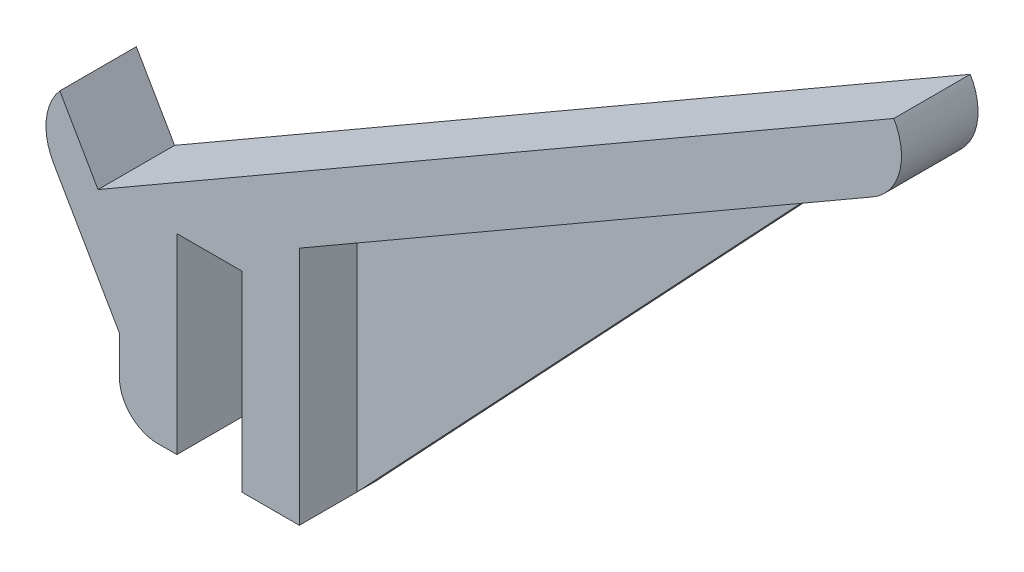
ISO-10303-21;
HEADER;
FILE_DESCRIPTION(('STEP AP214'),'2;1');
FILE_NAME('part.step','',(''),(''),'','','');
FILE_SCHEMA(('AUTOMOTIVE_DESIGN { 1 0 10303 214 1 1 1 1 }'));
ENDSEC;
DATA;
#1=APPLICATION_CONTEXT('core data for automotive mechanical design processes');
#2=APPLICATION_PROTOCOL_DEFINITION('international standard','automotive_design',2000,#1);
#3=PRODUCT_CONTEXT('',#1,'mechanical');
#4=PRODUCT('Part','Part','',(#3));
#5=PRODUCT_RELATED_PRODUCT_CATEGORY('part','',(#4));
#6=PRODUCT_DEFINITION_FORMATION('','',#4);
#7=PRODUCT_DEFINITION_CONTEXT('part definition',#1,'design');
#8=PRODUCT_DEFINITION('design','',#6,#7);
#9=PRODUCT_DEFINITION_SHAPE('','',#8);
#10=(LENGTH_UNIT() NAMED_UNIT(*) SI_UNIT(.MILLI.,.METRE.));
#11=(NAMED_UNIT(*) PLANE_ANGLE_UNIT() SI_UNIT($,.RADIAN.));
#12=(NAMED_UNIT(*) SI_UNIT($,.STERADIAN.) SOLID_ANGLE_UNIT());
#13=UNCERTAINTY_MEASURE_WITH_UNIT(LENGTH_MEASURE(1.E-05),#10,'distance_accuracy_value','');
#14=(GEOMETRIC_REPRESENTATION_CONTEXT(3) GLOBAL_UNCERTAINTY_ASSIGNED_CONTEXT((#13)) GLOBAL_UNIT_ASSIGNED_CONTEXT((#10,
#11,#12)) REPRESENTATION_CONTEXT('',''));
#15=CARTESIAN_POINT('',(0.,0.,0.));
#16=DIRECTION('',(0.,0.,1.));
#17=DIRECTION('',(1.,0.,0.));
#18=AXIS2_PLACEMENT_3D('',#15,#16,#17);
#19=CARTESIAN_POINT('',(15.,-50.,20.));
#20=DIRECTION('',(-1.,0.,0.));
#21=DIRECTION('',(0.,0.,1.));
#22=AXIS2_PLACEMENT_3D('',#19,#20,#21);
#23=PLANE('',#22);
#24=DIRECTION('',(0.,-1.,0.));
#25=VECTOR('',#24,1.);
#26=CARTESIAN_POINT('',(15.,12.7017059221715,5.));
#27=LINE('',#26,#25);
#28=CARTESIAN_POINT('',(15.,12.7017059221715,5.));
#29=VERTEX_POINT('',#28);
#30=CARTESIAN_POINT('',(15.,-50.,5.));
#31=VERTEX_POINT('',#30);
#32=EDGE_CURVE('E166',#29,#31,#27,.T.);
#33=ORIENTED_EDGE('',*,*,#32,.F.);
#34=DIRECTION('',(0.,0.,-1.));
#35=VECTOR('',#34,1.);
#36=CARTESIAN_POINT('',(15.,12.7017059221715,20.));
#37=LINE('',#36,#35);
#38=CARTESIAN_POINT('',(15.,12.7017059221715,20.));
#39=VERTEX_POINT('',#38);
#40=EDGE_CURVE('E236',#39,#29,#37,.T.);
#41=ORIENTED_EDGE('',*,*,#40,.F.);
#42=DIRECTION('',(0.,1.,0.));
#43=VECTOR('',#42,1.);
#44=CARTESIAN_POINT('',(15.,-50.,20.));
#45=LINE('',#44,#43);
#46=CARTESIAN_POINT('',(15.,-50.,20.));
#47=VERTEX_POINT('',#46);
#48=EDGE_CURVE('E184',#47,#39,#45,.T.);
#49=ORIENTED_EDGE('',*,*,#48,.F.);
#50=DIRECTION('',(0.,0.,-1.));
#51=VECTOR('',#50,1.);
#52=CARTESIAN_POINT('',(15.,-50.,20.));
#53=LINE('',#52,#51);
#54=EDGE_CURVE('E238',#47,#31,#53,.T.);
#55=ORIENTED_EDGE('',*,*,#54,.T.);
#56=EDGE_LOOP('',(#33,#41,#49,#55));
#57=FACE_BOUND('',#56,.T.);
#58=ADVANCED_FACE('F37',(#57),#23,.F.);
#59=CARTESIAN_POINT('',(15.,12.7017059221715,20.));
#60=DIRECTION('',(-0.500000000000001,0.866025403784438,0.));
#61=DIRECTION('',(-0.866025403784438,-0.500000000000001,0.));
#62=AXIS2_PLACEMENT_3D('',#59,#60,#61);
#63=PLANE('',#62);
#64=DIRECTION('',(0.866025403784438,0.500000000000001,0.));
#65=VECTOR('',#64,1.);
#66=CARTESIAN_POINT('',(15.,12.7017059221715,0.));
#67=LINE('',#66,#65);
#68=CARTESIAN_POINT('',(143.985349670657,87.1714322760432,0.));
#69=VERTEX_POINT('',#68);
#70=CARTESIAN_POINT('',(164.775588832577,99.1746824526945,0.));
#71=VERTEX_POINT('',#70);
#72=EDGE_CURVE('E144',#69,#71,#67,.T.);
#73=ORIENTED_EDGE('',*,*,#72,.T.);
#74=DIRECTION('',(0.,0.,-1.));
#75=VECTOR('',#74,1.);
#76=CARTESIAN_POINT('',(164.775588832576,99.1746824526945,20.));
#77=LINE('',#76,#75);
#78=CARTESIAN_POINT('',(164.775588832577,99.1746824526945,20.));
#79=VERTEX_POINT('',#78);
#80=EDGE_CURVE('E45',#71,#79,#77,.F.);
#81=ORIENTED_EDGE('',*,*,#80,.T.);
#82=DIRECTION('',(0.866025403784438,0.500000000000001,0.));
#83=VECTOR('',#82,1.);
#84=CARTESIAN_POINT('',(15.,12.7017059221715,20.));
#85=LINE('',#84,#83);
#86=EDGE_CURVE('E186',#39,#79,#85,.T.);
#87=ORIENTED_EDGE('',*,*,#86,.F.);
#88=ORIENTED_EDGE('',*,*,#40,.T.);
#89=DIRECTION('',(-0.866025403784439,-0.5,0.));
#90=VECTOR('',#89,1.);
#91=CARTESIAN_POINT('',(143.985349670657,87.1714322760432,5.));
#92=LINE('',#91,#90);
#93=CARTESIAN_POINT('',(143.985349670657,87.1714322760434,5.));
#94=VERTEX_POINT('',#93);
#95=EDGE_CURVE('E159',#94,#29,#92,.T.);
#96=ORIENTED_EDGE('',*,*,#95,.F.);
#97=DIRECTION('',(0.,0.,-1.));
#98=VECTOR('',#97,1.);
#99=CARTESIAN_POINT('',(143.985349670657,87.1714322760432,5.));
#100=LINE('',#99,#98);
#101=EDGE_CURVE('E155',#94,#69,#100,.T.);
#102=ORIENTED_EDGE('',*,*,#101,.T.);
#103=EDGE_LOOP('',(#73,#81,#87,#88,#96,#102));
#104=FACE_BOUND('',#103,.T.);
#105=ADVANCED_FACE('F156',(#104),#63,.F.);
#106=CARTESIAN_POINT('',(0.,0.,20.));
#107=DIRECTION('',(0.,1.,0.));
#108=DIRECTION('',(0.,0.,1.));
#109=AXIS2_PLACEMENT_3D('',#106,#107,#108);
#110=PLANE('',#109);
#111=DIRECTION('',(1.,0.,0.));
#112=VECTOR('',#111,1.);
#113=CARTESIAN_POINT('',(0.,0.,0.));
#114=LINE('',#113,#112);
#115=CARTESIAN_POINT('',(-17.,0.,0.));
#116=VERTEX_POINT('',#115);
#117=CARTESIAN_POINT('',(0.,0.,0.));
#118=VERTEX_POINT('',#117);
#119=EDGE_CURVE('E175',#116,#118,#114,.T.);
#120=ORIENTED_EDGE('',*,*,#119,.T.);
#121=DIRECTION('',(0.,0.,-1.));
#122=VECTOR('',#121,1.);
#123=CARTESIAN_POINT('',(0.,0.,20.));
#124=LINE('',#123,#122);
#125=CARTESIAN_POINT('',(0.,0.,20.));
#126=VERTEX_POINT('',#125);
#127=EDGE_CURVE('E244',#126,#118,#124,.T.);
#128=ORIENTED_EDGE('',*,*,#127,.F.);
#129=DIRECTION('',(1.,0.,0.));
#130=VECTOR('',#129,1.);
#131=CARTESIAN_POINT('',(0.,0.,20.));
#132=LINE('',#131,#130);
#133=CARTESIAN_POINT('',(-17.,0.,20.));
#134=VERTEX_POINT('',#133);
#135=EDGE_CURVE('E176',#134,#126,#132,.T.);
#136=ORIENTED_EDGE('',*,*,#135,.F.);
#137=DIRECTION('',(0.,0.,-1.));
#138=VECTOR('',#137,1.);
#139=CARTESIAN_POINT('',(-17.,0.,20.));
#140=LINE('',#139,#138);
#141=EDGE_CURVE('E201',#134,#116,#140,.T.);
#142=ORIENTED_EDGE('',*,*,#141,.T.);
#143=EDGE_LOOP('',(#120,#128,#136,#142));
#144=FACE_BOUND('',#143,.T.);
#145=ADVANCED_FACE('F312',(#144),#110,.F.);
#146=CARTESIAN_POINT('',(0.,0.,20.));
#147=DIRECTION('',(1.,0.,0.));
#148=DIRECTION('',(0.,1.,0.));
#149=AXIS2_PLACEMENT_3D('',#146,#147,#148);
#150=PLANE('',#149);
#151=DIRECTION('',(0.,-1.,0.));
#152=VECTOR('',#151,1.);
#153=CARTESIAN_POINT('',(0.,0.,0.));
#154=LINE('',#153,#152);
#155=CARTESIAN_POINT('',(0.,-50.,0.));
#156=VERTEX_POINT('',#155);
#157=EDGE_CURVE('E204',#118,#156,#154,.T.);
#158=ORIENTED_EDGE('',*,*,#157,.T.);
#159=DIRECTION('',(0.,0.,-1.));
#160=VECTOR('',#159,1.);
#161=CARTESIAN_POINT('',(0.,-50.,20.));
#162=LINE('',#161,#160);
#163=CARTESIAN_POINT('',(0.,-50.,20.));
#164=VERTEX_POINT('',#163);
#165=EDGE_CURVE('E241',#164,#156,#162,.T.);
#166=ORIENTED_EDGE('',*,*,#165,.F.);
#167=DIRECTION('',(0.,-1.,0.));
#168=VECTOR('',#167,1.);
#169=CARTESIAN_POINT('',(0.,0.,20.));
#170=LINE('',#169,#168);
#171=EDGE_CURVE('E179',#126,#164,#170,.T.);
#172=ORIENTED_EDGE('',*,*,#171,.F.);
#173=ORIENTED_EDGE('',*,*,#127,.T.);
#174=EDGE_LOOP('',(#158,#166,#172,#173));
#175=FACE_BOUND('',#174,.T.);
#176=ADVANCED_FACE('F319',(#175),#150,.F.);
#177=CARTESIAN_POINT('',(0.,-50.,20.));
#178=DIRECTION('',(0.,1.,0.));
#179=DIRECTION('',(0.,0.,1.));
#180=AXIS2_PLACEMENT_3D('',#177,#178,#179);
#181=PLANE('',#180);
#182=DIRECTION('',(1.,0.,0.));
#183=VECTOR('',#182,1.);
#184=CARTESIAN_POINT('',(0.,-50.,0.));
#185=LINE('',#184,#183);
#186=CARTESIAN_POINT('',(15.,-50.,0.));
#187=VERTEX_POINT('',#186);
#188=EDGE_CURVE('E152',#156,#187,#185,.T.);
#189=ORIENTED_EDGE('',*,*,#188,.T.);
#190=DIRECTION('',(0.,0.,-1.));
#191=VECTOR('',#190,1.);
#192=CARTESIAN_POINT('',(15.,-50.,5.));
#193=LINE('',#192,#191);
#194=EDGE_CURVE('E163',#31,#187,#193,.T.);
#195=ORIENTED_EDGE('',*,*,#194,.F.);
#196=ORIENTED_EDGE('',*,*,#54,.F.);
#197=DIRECTION('',(1.,0.,0.));
#198=VECTOR('',#197,1.);
#199=CARTESIAN_POINT('',(0.,-50.,20.));
#200=LINE('',#199,#198);
#201=EDGE_CURVE('E182',#164,#47,#200,.T.);
#202=ORIENTED_EDGE('',*,*,#201,.F.);
#203=ORIENTED_EDGE('',*,*,#165,.T.);
#204=EDGE_LOOP('',(#189,#195,#196,#202,#203));
#205=FACE_BOUND('',#204,.T.);
#206=ADVANCED_FACE('F316',(#205),#181,.F.);
#207=CARTESIAN_POINT('',(-37.5801270189222,-0.334936490538917,20.));
#208=DIRECTION('',(0.5,-0.866025403784439,0.));
#209=DIRECTION('',(0.866025403784439,0.5,0.));
#210=AXIS2_PLACEMENT_3D('',#207,#208,#209);
#211=PLANE('',#210);
#212=DIRECTION('',(-0.866025403784439,-0.5,0.));
#213=VECTOR('',#212,1.);
#214=CARTESIAN_POINT('',(-37.5801270189222,-0.334936490538917,0.));
#215=LINE('',#214,#213);
#216=CARTESIAN_POINT('',(170.265969889343,119.665063509461,0.));
#217=VERTEX_POINT('',#216);
#218=CARTESIAN_POINT('',(-37.5801270189222,-0.334936490538917,0.));
#219=VERTEX_POINT('',#218);
#220=EDGE_CURVE('E151',#217,#219,#215,.T.);
#221=ORIENTED_EDGE('',*,*,#220,.T.);
#222=DIRECTION('',(0.,0.,-1.));
#223=VECTOR('',#222,1.);
#224=CARTESIAN_POINT('',(-37.5801270189222,-0.334936490538917,20.));
#225=LINE('',#224,#223);
#226=CARTESIAN_POINT('',(-37.5801270189222,-0.334936490538917,20.));
#227=VERTEX_POINT('',#226);
#228=EDGE_CURVE('E230',#227,#219,#225,.T.);
#229=ORIENTED_EDGE('',*,*,#228,.F.);
#230=DIRECTION('',(-0.866025403784439,-0.5,0.));
#231=VECTOR('',#230,1.);
#232=CARTESIAN_POINT('',(-37.5801270189222,-0.334936490538917,20.));
#233=LINE('',#232,#231);
#234=CARTESIAN_POINT('',(170.265969889343,119.665063509461,20.));
#235=VERTEX_POINT('',#234);
#236=EDGE_CURVE('E188',#235,#227,#233,.T.);
#237=ORIENTED_EDGE('',*,*,#236,.F.);
#238=DIRECTION('',(0.,0.,-1.));
#239=VECTOR('',#238,1.);
#240=CARTESIAN_POINT('',(170.265969889343,119.665063509461,20.));
#241=LINE('',#240,#239);
#242=EDGE_CURVE('E233',#235,#217,#241,.T.);
#243=ORIENTED_EDGE('',*,*,#242,.T.);
#244=EDGE_LOOP('',(#221,#229,#237,#243));
#245=FACE_BOUND('',#244,.T.);
#246=ADVANCED_FACE('F300',(#245),#211,.F.);
#247=CARTESIAN_POINT('',(-47.5801270189222,16.9855715851499,20.));
#248=DIRECTION('',(-0.866025403784438,-0.5,0.));
#249=DIRECTION('',(0.5,-0.866025403784438,0.));
#250=AXIS2_PLACEMENT_3D('',#247,#248,#249);
#251=PLANE('',#250);
#252=DIRECTION('',(-0.5,0.866025403784438,0.));
#253=VECTOR('',#252,1.);
#254=CARTESIAN_POINT('',(-47.5801270189222,16.9855715851499,0.));
#255=LINE('',#254,#253);
#256=CARTESIAN_POINT('',(-47.5801270189222,16.9855715851499,0.));
#257=VERTEX_POINT('',#256);
#258=EDGE_CURVE('E208',#219,#257,#255,.T.);
#259=ORIENTED_EDGE('',*,*,#258,.T.);
#260=DIRECTION('',(0.,0.,-1.));
#261=VECTOR('',#260,1.);
#262=CARTESIAN_POINT('',(-47.5801270189222,16.9855715851499,20.));
#263=LINE('',#262,#261);
#264=CARTESIAN_POINT('',(-47.5801270189222,16.9855715851499,20.));
#265=VERTEX_POINT('',#264);
#266=EDGE_CURVE('E227',#265,#257,#263,.T.);
#267=ORIENTED_EDGE('',*,*,#266,.F.);
#268=DIRECTION('',(-0.5,0.866025403784438,0.));
#269=VECTOR('',#268,1.);
#270=CARTESIAN_POINT('',(-47.5801270189222,16.9855715851499,20.));
#271=LINE('',#270,#269);
#272=EDGE_CURVE('E190',#227,#265,#271,.T.);
#273=ORIENTED_EDGE('',*,*,#272,.F.);
#274=ORIENTED_EDGE('',*,*,#228,.T.);
#275=EDGE_LOOP('',(#259,#267,#273,#274));
#276=FACE_BOUND('',#275,.T.);
#277=ADVANCED_FACE('F291',(#276),#251,.F.);
#278=CARTESIAN_POINT('',(-32.,-30.,20.));
#279=DIRECTION('',(0.866025403784438,0.500000000000001,0.));
#280=DIRECTION('',(-0.500000000000001,0.866025403784438,0.));
#281=AXIS2_PLACEMENT_3D('',#278,#279,#280);
#282=PLANE('',#281);
#283=DIRECTION('',(0.500000000000001,-0.866025403784438,0.));
#284=VECTOR('',#283,1.);
#285=CARTESIAN_POINT('',(-32.,-30.,20.));
#286=LINE('',#285,#284);
#287=CARTESIAN_POINT('',(-49.1693132449011,-0.261877128766033,20.));
#288=VERTEX_POINT('',#287);
#289=CARTESIAN_POINT('',(-32.,-30.,20.));
#290=VERTEX_POINT('',#289);
#291=EDGE_CURVE('E192',#288,#290,#286,.T.);
#292=ORIENTED_EDGE('',*,*,#291,.F.);
#293=DIRECTION('',(0.,0.,-1.));
#294=VECTOR('',#293,1.);
#295=CARTESIAN_POINT('',(-49.1693132449011,-0.261877128766026,20.));
#296=LINE('',#295,#294);
#297=CARTESIAN_POINT('',(-49.1693132449011,-0.261877128766033,0.));
#298=VERTEX_POINT('',#297);
#299=EDGE_CURVE('E247',#288,#298,#296,.T.);
#300=ORIENTED_EDGE('',*,*,#299,.T.);
#301=DIRECTION('',(0.500000000000001,-0.866025403784438,0.));
#302=VECTOR('',#301,1.);
#303=CARTESIAN_POINT('',(-32.,-30.,0.));
#304=LINE('',#303,#302);
#305=CARTESIAN_POINT('',(-32.,-30.,0.));
#306=VERTEX_POINT('',#305);
#307=EDGE_CURVE('E211',#298,#306,#304,.T.);
#308=ORIENTED_EDGE('',*,*,#307,.T.);
#309=DIRECTION('',(0.,0.,-1.));
#310=VECTOR('',#309,1.);
#311=CARTESIAN_POINT('',(-32.,-30.,20.));
#312=LINE('',#311,#310);
#313=EDGE_CURVE('E224',#290,#306,#312,.T.);
#314=ORIENTED_EDGE('',*,*,#313,.F.);
#315=EDGE_LOOP('',(#292,#300,#308,#314));
#316=FACE_BOUND('',#315,.T.);
#317=ADVANCED_FACE('F285',(#316),#282,.F.);
#318=CARTESIAN_POINT('',(-32.,-50.,20.));
#319=DIRECTION('',(1.,0.,0.));
#320=DIRECTION('',(0.,0.,-1.));
#321=AXIS2_PLACEMENT_3D('',#318,#319,#320);
#322=PLANE('',#321);
#323=DIRECTION('',(0.,-1.,0.));
#324=VECTOR('',#323,1.);
#325=CARTESIAN_POINT('',(-32.,-50.,0.));
#326=LINE('',#325,#324);
#327=CARTESIAN_POINT('',(-32.,-40.,0.));
#328=VERTEX_POINT('',#327);
#329=EDGE_CURVE('E213',#306,#328,#326,.T.);
#330=ORIENTED_EDGE('',*,*,#329,.T.);
#331=DIRECTION('',(0.,0.,-1.));
#332=VECTOR('',#331,1.);
#333=CARTESIAN_POINT('',(-32.,-40.,20.));
#334=LINE('',#333,#332);
#335=CARTESIAN_POINT('',(-32.,-40.,20.));
#336=VERTEX_POINT('',#335);
#337=EDGE_CURVE('E259',#328,#336,#334,.F.);
#338=ORIENTED_EDGE('',*,*,#337,.T.);
#339=DIRECTION('',(0.,-1.,0.));
#340=VECTOR('',#339,1.);
#341=CARTESIAN_POINT('',(-32.,-50.,20.));
#342=LINE('',#341,#340);
#343=EDGE_CURVE('E194',#290,#336,#342,.T.);
#344=ORIENTED_EDGE('',*,*,#343,.F.);
#345=ORIENTED_EDGE('',*,*,#313,.T.);
#346=EDGE_LOOP('',(#330,#338,#344,#345));
#347=FACE_BOUND('',#346,.T.);
#348=ADVANCED_FACE('F281',(#347),#322,.F.);
#349=CARTESIAN_POINT('',(-17.,-50.,20.));
#350=DIRECTION('',(0.,1.,0.));
#351=DIRECTION('',(-1.,0.,0.));
#352=AXIS2_PLACEMENT_3D('',#349,#350,#351);
#353=PLANE('',#352);
#354=DIRECTION('',(1.,0.,0.));
#355=VECTOR('',#354,1.);
#356=CARTESIAN_POINT('',(-17.,-50.,20.));
#357=LINE('',#356,#355);
#358=CARTESIAN_POINT('',(-22.,-50.,20.));
#359=VERTEX_POINT('',#358);
#360=CARTESIAN_POINT('',(-17.,-50.,20.));
#361=VERTEX_POINT('',#360);
#362=EDGE_CURVE('E197',#359,#361,#357,.T.);
#363=ORIENTED_EDGE('',*,*,#362,.F.);
#364=DIRECTION('',(0.,0.,-1.));
#365=VECTOR('',#364,1.);
#366=CARTESIAN_POINT('',(-22.,-50.,20.));
#367=LINE('',#366,#365);
#368=CARTESIAN_POINT('',(-22.,-50.,0.));
#369=VERTEX_POINT('',#368);
#370=EDGE_CURVE('E254',#359,#369,#367,.T.);
#371=ORIENTED_EDGE('',*,*,#370,.T.);
#372=DIRECTION('',(1.,0.,0.));
#373=VECTOR('',#372,1.);
#374=CARTESIAN_POINT('',(-17.,-50.,0.));
#375=LINE('',#374,#373);
#376=CARTESIAN_POINT('',(-17.,-50.,0.));
#377=VERTEX_POINT('',#376);
#378=EDGE_CURVE('E216',#369,#377,#375,.T.);
#379=ORIENTED_EDGE('',*,*,#378,.T.);
#380=DIRECTION('',(0.,0.,-1.));
#381=VECTOR('',#380,1.);
#382=CARTESIAN_POINT('',(-17.,-50.,20.));
#383=LINE('',#382,#381);
#384=EDGE_CURVE('E221',#361,#377,#383,.T.);
#385=ORIENTED_EDGE('',*,*,#384,.F.);
#386=EDGE_LOOP('',(#363,#371,#379,#385));
#387=FACE_BOUND('',#386,.T.);
#388=ADVANCED_FACE('F273',(#387),#353,.F.);
#389=CARTESIAN_POINT('',(-17.,0.,20.));
#390=DIRECTION('',(-1.,0.,0.));
#391=DIRECTION('',(0.,-1.,0.));
#392=AXIS2_PLACEMENT_3D('',#389,#390,#391);
#393=PLANE('',#392);
#394=DIRECTION('',(0.,1.,0.));
#395=VECTOR('',#394,1.);
#396=CARTESIAN_POINT('',(-17.,0.,0.));
#397=LINE('',#396,#395);
#398=EDGE_CURVE('E180',#377,#116,#397,.T.);
#399=ORIENTED_EDGE('',*,*,#398,.T.);
#400=ORIENTED_EDGE('',*,*,#141,.F.);
#401=DIRECTION('',(0.,1.,0.));
#402=VECTOR('',#401,1.);
#403=CARTESIAN_POINT('',(-17.,0.,20.));
#404=LINE('',#403,#402);
#405=EDGE_CURVE('E199',#361,#134,#404,.T.);
#406=ORIENTED_EDGE('',*,*,#405,.F.);
#407=ORIENTED_EDGE('',*,*,#384,.T.);
#408=EDGE_LOOP('',(#399,#400,#406,#407));
#409=FACE_BOUND('',#408,.T.);
#410=ADVANCED_FACE('F341',(#409),#393,.F.);
#411=CARTESIAN_POINT('',(0.,0.,20.));
#412=DIRECTION('',(0.,0.,1.));
#413=DIRECTION('',(1.,0.,0.));
#414=AXIS2_PLACEMENT_3D('',#411,#412,#413);
#415=PLANE('',#414);
#416=ORIENTED_EDGE('',*,*,#86,.T.);
#417=CARTESIAN_POINT('',(157.275588832576,112.165063509461,20.));
#418=DIRECTION('',(0.,0.,1.));
#419=DIRECTION('',(1.,0.,0.));
#420=AXIS2_PLACEMENT_3D('',#417,#418,#419);
#421=CIRCLE('',#420,15.);
#422=EDGE_CURVE('E11',#79,#235,#421,.T.);
#423=ORIENTED_EDGE('',*,*,#422,.T.);
#424=ORIENTED_EDGE('',*,*,#236,.T.);
#425=ORIENTED_EDGE('',*,*,#272,.T.);
#426=CARTESIAN_POINT('',(-36.1789321881345,7.23812287123398,20.));
#427=DIRECTION('',(0.,0.,1.));
#428=DIRECTION('',(1.,0.,0.));
#429=AXIS2_PLACEMENT_3D('',#426,#427,#428);
#430=CIRCLE('',#429,15.);
#431=EDGE_CURVE('E252',#265,#288,#430,.T.);
#432=ORIENTED_EDGE('',*,*,#431,.T.);
#433=ORIENTED_EDGE('',*,*,#291,.T.);
#434=ORIENTED_EDGE('',*,*,#343,.T.);
#435=CARTESIAN_POINT('',(-22.,-40.,20.));
#436=DIRECTION('',(0.,0.,1.));
#437=DIRECTION('',(1.,0.,0.));
#438=AXIS2_PLACEMENT_3D('',#435,#436,#437);
#439=CIRCLE('',#438,10.);
#440=EDGE_CURVE('E261',#336,#359,#439,.T.);
#441=ORIENTED_EDGE('',*,*,#440,.T.);
#442=ORIENTED_EDGE('',*,*,#362,.T.);
#443=ORIENTED_EDGE('',*,*,#405,.T.);
#444=ORIENTED_EDGE('',*,*,#135,.T.);
#445=ORIENTED_EDGE('',*,*,#171,.T.);
#446=ORIENTED_EDGE('',*,*,#201,.T.);
#447=ORIENTED_EDGE('',*,*,#48,.T.);
#448=EDGE_LOOP('',(#416,#423,#424,#425,#432,#433,#434,#441,#442,#443,#444,#445,#446,#447));
#449=FACE_BOUND('',#448,.T.);
#450=ADVANCED_FACE('F266',(#449),#415,.T.);
#451=CARTESIAN_POINT('',(0.,0.,0.));
#452=DIRECTION('',(0.,0.,1.));
#453=DIRECTION('',(1.,0.,0.));
#454=AXIS2_PLACEMENT_3D('',#451,#452,#453);
#455=PLANE('',#454);
#456=ORIENTED_EDGE('',*,*,#220,.F.);
#457=CARTESIAN_POINT('',(157.275588832576,112.165063509461,0.));
#458=DIRECTION('',(0.,0.,1.));
#459=DIRECTION('',(1.,0.,0.));
#460=AXIS2_PLACEMENT_3D('',#457,#458,#459);
#461=CIRCLE('',#460,15.);
#462=EDGE_CURVE('E59',#217,#71,#461,.F.);
#463=ORIENTED_EDGE('',*,*,#462,.T.);
#464=ORIENTED_EDGE('',*,*,#72,.F.);
#465=DIRECTION('',(0.68503463330093,0.728510501762507,0.));
#466=VECTOR('',#465,1.);
#467=CARTESIAN_POINT('',(15.,-50.,0.));
#468=LINE('',#467,#466);
#469=EDGE_CURVE('E149',#187,#69,#468,.T.);
#470=ORIENTED_EDGE('',*,*,#469,.F.);
#471=ORIENTED_EDGE('',*,*,#188,.F.);
#472=ORIENTED_EDGE('',*,*,#157,.F.);
#473=ORIENTED_EDGE('',*,*,#119,.F.);
#474=ORIENTED_EDGE('',*,*,#398,.F.);
#475=ORIENTED_EDGE('',*,*,#378,.F.);
#476=CARTESIAN_POINT('',(-22.,-40.,0.));
#477=DIRECTION('',(0.,0.,1.));
#478=DIRECTION('',(1.,0.,0.));
#479=AXIS2_PLACEMENT_3D('',#476,#477,#478);
#480=CIRCLE('',#479,10.);
#481=EDGE_CURVE('E257',#369,#328,#480,.F.);
#482=ORIENTED_EDGE('',*,*,#481,.T.);
#483=ORIENTED_EDGE('',*,*,#329,.F.);
#484=ORIENTED_EDGE('',*,*,#307,.F.);
#485=CARTESIAN_POINT('',(-36.1789321881345,7.23812287123398,0.));
#486=DIRECTION('',(0.,0.,1.));
#487=DIRECTION('',(1.,0.,0.));
#488=AXIS2_PLACEMENT_3D('',#485,#486,#487);
#489=CIRCLE('',#488,15.);
#490=EDGE_CURVE('E250',#298,#257,#489,.F.);
#491=ORIENTED_EDGE('',*,*,#490,.T.);
#492=ORIENTED_EDGE('',*,*,#258,.F.);
#493=EDGE_LOOP('',(#456,#463,#464,#470,#471,#472,#473,#474,#475,#482,#483,#484,#491,#492));
#494=FACE_BOUND('',#493,.T.);
#495=ADVANCED_FACE('F146',(#494),#455,.F.);
#496=CARTESIAN_POINT('',(15.,-50.,5.));
#497=DIRECTION('',(-0.728510501762507,0.68503463330093,0.));
#498=DIRECTION('',(-0.68503463330093,-0.728510501762507,0.));
#499=AXIS2_PLACEMENT_3D('',#496,#497,#498);
#500=PLANE('',#499);
#501=ORIENTED_EDGE('',*,*,#469,.T.);
#502=ORIENTED_EDGE('',*,*,#101,.F.);
#503=DIRECTION('',(0.68503463330093,0.728510501762507,0.));
#504=VECTOR('',#503,1.);
#505=CARTESIAN_POINT('',(15.,-50.,5.));
#506=LINE('',#505,#504);
#507=EDGE_CURVE('E169',#31,#94,#506,.T.);
#508=ORIENTED_EDGE('',*,*,#507,.F.);
#509=ORIENTED_EDGE('',*,*,#194,.T.);
#510=EDGE_LOOP('',(#501,#502,#508,#509));
#511=FACE_BOUND('',#510,.T.);
#512=ADVANCED_FACE('F165',(#511),#500,.F.);
#513=CARTESIAN_POINT('',(0.,0.,5.));
#514=DIRECTION('',(0.,0.,-1.));
#515=DIRECTION('',(-1.,0.,0.));
#516=AXIS2_PLACEMENT_3D('',#513,#514,#515);
#517=PLANE('',#516);
#518=ORIENTED_EDGE('',*,*,#32,.T.);
#519=ORIENTED_EDGE('',*,*,#507,.T.);
#520=ORIENTED_EDGE('',*,*,#95,.T.);
#521=EDGE_LOOP('',(#518,#519,#520));
#522=FACE_BOUND('',#521,.T.);
#523=ADVANCED_FACE('F328',(#522),#517,.F.);
#524=CARTESIAN_POINT('',(-36.1789321881345,7.23812287123398,20.));
#525=DIRECTION('',(0.,0.,-1.));
#526=DIRECTION('',(-1.,0.,0.));
#527=AXIS2_PLACEMENT_3D('',#524,#525,#526);
#528=CYLINDRICAL_SURFACE('',#527,15.);
#529=ORIENTED_EDGE('',*,*,#431,.F.);
#530=ORIENTED_EDGE('',*,*,#266,.T.);
#531=ORIENTED_EDGE('',*,*,#490,.F.);
#532=ORIENTED_EDGE('',*,*,#299,.F.);
#533=EDGE_LOOP('',(#529,#530,#531,#532));
#534=FACE_BOUND('',#533,.T.);
#535=ADVANCED_FACE('F295',(#534),#528,.T.);
#536=CARTESIAN_POINT('',(-22.,-40.,20.));
#537=DIRECTION('',(0.,0.,-1.));
#538=DIRECTION('',(-1.,0.,0.));
#539=AXIS2_PLACEMENT_3D('',#536,#537,#538);
#540=CYLINDRICAL_SURFACE('',#539,10.);
#541=ORIENTED_EDGE('',*,*,#440,.F.);
#542=ORIENTED_EDGE('',*,*,#337,.F.);
#543=ORIENTED_EDGE('',*,*,#481,.F.);
#544=ORIENTED_EDGE('',*,*,#370,.F.);
#545=EDGE_LOOP('',(#541,#542,#543,#544));
#546=FACE_BOUND('',#545,.T.);
#547=ADVANCED_FACE('F276',(#546),#540,.T.);
#548=CARTESIAN_POINT('',(157.275588832576,112.165063509461,20.));
#549=DIRECTION('',(0.,0.,-1.));
#550=DIRECTION('',(-1.,0.,0.));
#551=AXIS2_PLACEMENT_3D('',#548,#549,#550);
#552=CYLINDRICAL_SURFACE('',#551,15.);
#553=ORIENTED_EDGE('',*,*,#422,.F.);
#554=ORIENTED_EDGE('',*,*,#80,.F.);
#555=ORIENTED_EDGE('',*,*,#462,.F.);
#556=ORIENTED_EDGE('',*,*,#242,.F.);
#557=EDGE_LOOP('',(#553,#554,#555,#556));
#558=FACE_BOUND('',#557,.T.);
#559=ADVANCED_FACE('F39',(#558),#552,.T.);
#560=CLOSED_SHELL('',(#58,#105,#145,#176,#206,#246,#277,#317,#348,#388,#410,#450,#495,#512,#523,
#535,#547,#559));
#561=MANIFOLD_SOLID_BREP('B2',#560);
#562=ADVANCED_BREP_SHAPE_REPRESENTATION('',(#18,#561),#14);
#563=SHAPE_DEFINITION_REPRESENTATION(#9,#562);
ENDSEC;
END-ISO-10303-21;
